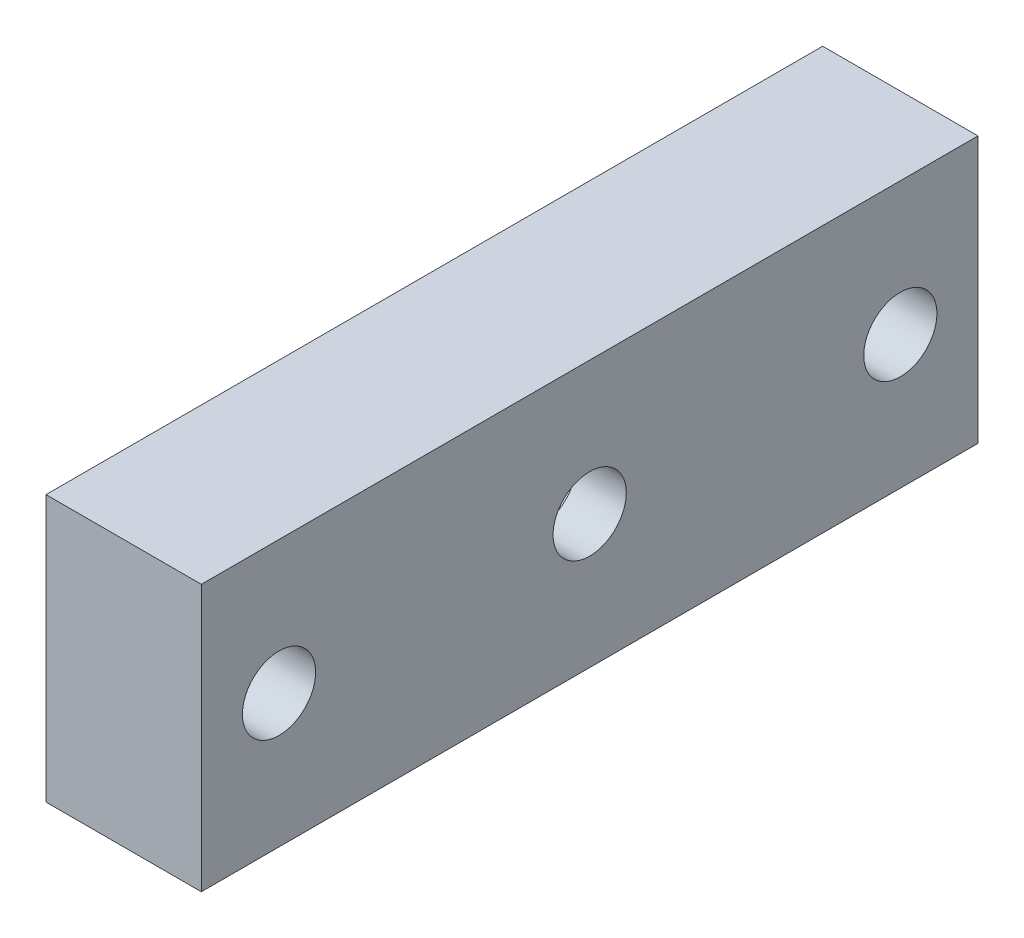
ISO-10303-21;
HEADER;
FILE_DESCRIPTION(('STEP AP214'),'2;1');
FILE_NAME('part.step','',(''),(''),'','','');
FILE_SCHEMA(('AUTOMOTIVE_DESIGN { 1 0 10303 214 1 1 1 1 }'));
ENDSEC;
DATA;
#1=APPLICATION_CONTEXT('core data for automotive mechanical design processes');
#2=APPLICATION_PROTOCOL_DEFINITION('international standard','automotive_design',2000,#1);
#3=PRODUCT_CONTEXT('',#1,'mechanical');
#4=PRODUCT('Part','Part','',(#3));
#5=PRODUCT_RELATED_PRODUCT_CATEGORY('part','',(#4));
#6=PRODUCT_DEFINITION_FORMATION('','',#4);
#7=PRODUCT_DEFINITION_CONTEXT('part definition',#1,'design');
#8=PRODUCT_DEFINITION('design','',#6,#7);
#9=PRODUCT_DEFINITION_SHAPE('','',#8);
#10=(LENGTH_UNIT() NAMED_UNIT(*) SI_UNIT(.MILLI.,.METRE.));
#11=(NAMED_UNIT(*) PLANE_ANGLE_UNIT() SI_UNIT($,.RADIAN.));
#12=(NAMED_UNIT(*) SI_UNIT($,.STERADIAN.) SOLID_ANGLE_UNIT());
#13=UNCERTAINTY_MEASURE_WITH_UNIT(LENGTH_MEASURE(1.E-05),#10,'distance_accuracy_value','');
#14=(GEOMETRIC_REPRESENTATION_CONTEXT(3) GLOBAL_UNCERTAINTY_ASSIGNED_CONTEXT((#13)) GLOBAL_UNIT_ASSIGNED_CONTEXT((#10,
#11,#12)) REPRESENTATION_CONTEXT('',''));
#15=CARTESIAN_POINT('',(0.,0.,0.));
#16=DIRECTION('',(0.,0.,1.));
#17=DIRECTION('',(1.,0.,0.));
#18=AXIS2_PLACEMENT_3D('',#15,#16,#17);
#19=CARTESIAN_POINT('',(7.,6.,-17.5));
#20=DIRECTION('',(-1.,0.,0.));
#21=DIRECTION('',(0.,0.,1.));
#22=AXIS2_PLACEMENT_3D('',#19,#20,#21);
#23=CYLINDRICAL_SURFACE('',#22,1.65);
#24=CARTESIAN_POINT('',(0.,6.,-17.5));
#25=DIRECTION('',(1.,0.,0.));
#26=DIRECTION('',(0.,0.,-1.));
#27=AXIS2_PLACEMENT_3D('',#24,#25,#26);
#28=CIRCLE('',#27,1.65);
#29=CARTESIAN_POINT('',(0.,6.,-19.15));
#30=VERTEX_POINT('',#29);
#31=EDGE_CURVE('E189',#30,#30,#28,.T.);
#32=ORIENTED_EDGE('',*,*,#31,.F.);
#33=EDGE_LOOP('',(#32));
#34=FACE_BOUND('',#33,.T.);
#35=CARTESIAN_POINT('',(2.25,6.,-17.5));
#36=DIRECTION('',(1.,0.,0.));
#37=DIRECTION('',(0.,0.,-1.));
#38=AXIS2_PLACEMENT_3D('',#35,#36,#37);
#39=CIRCLE('',#38,1.65);
#40=CARTESIAN_POINT('',(2.25,6.,-19.15));
#41=VERTEX_POINT('',#40);
#42=EDGE_CURVE('E41',#41,#41,#39,.T.);
#43=ORIENTED_EDGE('',*,*,#42,.T.);
#44=EDGE_LOOP('',(#43));
#45=FACE_BOUND('',#44,.T.);
#46=ADVANCED_FACE('F37',(#34,#45),#23,.F.);
#47=CARTESIAN_POINT('',(7.,0.,0.));
#48=DIRECTION('',(-1.,0.,0.));
#49=DIRECTION('',(0.,0.,1.));
#50=AXIS2_PLACEMENT_3D('',#47,#48,#49);
#51=PLANE('',#50);
#52=DIRECTION('',(0.,-1.,0.));
#53=VECTOR('',#52,1.);
#54=CARTESIAN_POINT('',(7.,0.,0.));
#55=LINE('',#54,#53);
#56=CARTESIAN_POINT('',(7.,12.,0.));
#57=VERTEX_POINT('',#56);
#58=CARTESIAN_POINT('',(7.,0.,0.));
#59=VERTEX_POINT('',#58);
#60=EDGE_CURVE('E204',#57,#59,#55,.T.);
#61=ORIENTED_EDGE('',*,*,#60,.T.);
#62=DIRECTION('',(0.,0.,-1.));
#63=VECTOR('',#62,1.);
#64=CARTESIAN_POINT('',(7.,0.,0.));
#65=LINE('',#64,#63);
#66=CARTESIAN_POINT('',(7.,0.,-35.));
#67=VERTEX_POINT('',#66);
#68=EDGE_CURVE('E87',#59,#67,#65,.T.);
#69=ORIENTED_EDGE('',*,*,#68,.T.);
#70=DIRECTION('',(0.,1.,0.));
#71=VECTOR('',#70,1.);
#72=CARTESIAN_POINT('',(7.,0.,-35.));
#73=LINE('',#72,#71);
#74=CARTESIAN_POINT('',(7.,12.,-35.));
#75=VERTEX_POINT('',#74);
#76=EDGE_CURVE('E207',#67,#75,#73,.T.);
#77=ORIENTED_EDGE('',*,*,#76,.T.);
#78=DIRECTION('',(0.,0.,1.));
#79=VECTOR('',#78,1.);
#80=CARTESIAN_POINT('',(7.,12.,0.));
#81=LINE('',#80,#79);
#82=EDGE_CURVE('E56',#75,#57,#81,.T.);
#83=ORIENTED_EDGE('',*,*,#82,.T.);
#84=EDGE_LOOP('',(#61,#69,#77,#83));
#85=FACE_BOUND('',#84,.T.);
#86=CARTESIAN_POINT('',(7.,6.,-3.5));
#87=DIRECTION('',(1.,0.,0.));
#88=DIRECTION('',(0.,0.,-1.));
#89=AXIS2_PLACEMENT_3D('',#86,#87,#88);
#90=CIRCLE('',#89,1.65);
#91=CARTESIAN_POINT('',(7.,6.,-5.15));
#92=VERTEX_POINT('',#91);
#93=EDGE_CURVE('E198',#92,#92,#90,.T.);
#94=ORIENTED_EDGE('',*,*,#93,.F.);
#95=EDGE_LOOP('',(#94));
#96=FACE_BOUND('',#95,.T.);
#97=CARTESIAN_POINT('',(7.,6.,-31.5));
#98=DIRECTION('',(1.,0.,0.));
#99=DIRECTION('',(0.,0.,-1.));
#100=AXIS2_PLACEMENT_3D('',#97,#98,#99);
#101=CIRCLE('',#100,1.65);
#102=CARTESIAN_POINT('',(7.,6.,-33.15));
#103=VERTEX_POINT('',#102);
#104=EDGE_CURVE('E192',#103,#103,#101,.T.);
#105=ORIENTED_EDGE('',*,*,#104,.F.);
#106=EDGE_LOOP('',(#105));
#107=FACE_BOUND('',#106,.T.);
#108=CARTESIAN_POINT('',(7.,6.,-17.5));
#109=DIRECTION('',(1.,0.,0.));
#110=DIRECTION('',(0.,0.,-1.));
#111=AXIS2_PLACEMENT_3D('',#108,#109,#110);
#112=CIRCLE('',#111,1.65);
#113=CARTESIAN_POINT('',(7.,6.,-19.15));
#114=VERTEX_POINT('',#113);
#115=EDGE_CURVE('E185',#114,#114,#112,.T.);
#116=ORIENTED_EDGE('',*,*,#115,.F.);
#117=EDGE_LOOP('',(#116));
#118=FACE_BOUND('',#117,.T.);
#119=ADVANCED_FACE('F238',(#85,#96,#107,#118),#51,.F.);
#120=CARTESIAN_POINT('',(0.,0.,0.));
#121=DIRECTION('',(-1.,0.,0.));
#122=DIRECTION('',(0.,0.,1.));
#123=AXIS2_PLACEMENT_3D('',#120,#121,#122);
#124=PLANE('',#123);
#125=CARTESIAN_POINT('',(0.,6.,-31.5));
#126=DIRECTION('',(1.,0.,0.));
#127=DIRECTION('',(0.,0.,-1.));
#128=AXIS2_PLACEMENT_3D('',#125,#126,#127);
#129=CIRCLE('',#128,1.65);
#130=CARTESIAN_POINT('',(0.,6.,-33.15));
#131=VERTEX_POINT('',#130);
#132=EDGE_CURVE('E188',#131,#131,#129,.T.);
#133=ORIENTED_EDGE('',*,*,#132,.T.);
#134=EDGE_LOOP('',(#133));
#135=FACE_BOUND('',#134,.T.);
#136=DIRECTION('',(0.,-1.,0.));
#137=VECTOR('',#136,1.);
#138=CARTESIAN_POINT('',(0.,0.,0.));
#139=LINE('',#138,#137);
#140=CARTESIAN_POINT('',(0.,12.,0.));
#141=VERTEX_POINT('',#140);
#142=CARTESIAN_POINT('',(0.,0.,0.));
#143=VERTEX_POINT('',#142);
#144=EDGE_CURVE('E201',#141,#143,#139,.T.);
#145=ORIENTED_EDGE('',*,*,#144,.F.);
#146=DIRECTION('',(0.,0.,1.));
#147=VECTOR('',#146,1.);
#148=CARTESIAN_POINT('',(0.,12.,0.));
#149=LINE('',#148,#147);
#150=CARTESIAN_POINT('',(0.,12.,-35.));
#151=VERTEX_POINT('',#150);
#152=EDGE_CURVE('E80',#151,#141,#149,.T.);
#153=ORIENTED_EDGE('',*,*,#152,.F.);
#154=DIRECTION('',(0.,1.,0.));
#155=VECTOR('',#154,1.);
#156=CARTESIAN_POINT('',(0.,0.,-35.));
#157=LINE('',#156,#155);
#158=CARTESIAN_POINT('',(0.,0.,-35.));
#159=VERTEX_POINT('',#158);
#160=EDGE_CURVE('E74',#159,#151,#157,.T.);
#161=ORIENTED_EDGE('',*,*,#160,.F.);
#162=DIRECTION('',(0.,0.,-1.));
#163=VECTOR('',#162,1.);
#164=CARTESIAN_POINT('',(0.,0.,0.));
#165=LINE('',#164,#163);
#166=EDGE_CURVE('E213',#143,#159,#165,.T.);
#167=ORIENTED_EDGE('',*,*,#166,.F.);
#168=EDGE_LOOP('',(#145,#153,#161,#167));
#169=FACE_BOUND('',#168,.T.);
#170=CARTESIAN_POINT('',(0.,6.,-3.5));
#171=DIRECTION('',(1.,0.,0.));
#172=DIRECTION('',(0.,0.,-1.));
#173=AXIS2_PLACEMENT_3D('',#170,#171,#172);
#174=CIRCLE('',#173,1.65);
#175=CARTESIAN_POINT('',(0.,6.,-5.15));
#176=VERTEX_POINT('',#175);
#177=EDGE_CURVE('E195',#176,#176,#174,.T.);
#178=ORIENTED_EDGE('',*,*,#177,.T.);
#179=EDGE_LOOP('',(#178));
#180=FACE_BOUND('',#179,.T.);
#181=ORIENTED_EDGE('',*,*,#31,.T.);
#182=EDGE_LOOP('',(#181));
#183=FACE_BOUND('',#182,.T.);
#184=ADVANCED_FACE('F247',(#135,#169,#180,#183),#124,.T.);
#185=CARTESIAN_POINT('',(7.,0.,0.));
#186=DIRECTION('',(0.,0.,-1.));
#187=DIRECTION('',(-1.,0.,0.));
#188=AXIS2_PLACEMENT_3D('',#185,#186,#187);
#189=PLANE('',#188);
#190=ORIENTED_EDGE('',*,*,#144,.T.);
#191=DIRECTION('',(-1.,0.,0.));
#192=VECTOR('',#191,1.);
#193=CARTESIAN_POINT('',(7.,0.,0.));
#194=LINE('',#193,#192);
#195=EDGE_CURVE('E11',#59,#143,#194,.T.);
#196=ORIENTED_EDGE('',*,*,#195,.F.);
#197=ORIENTED_EDGE('',*,*,#60,.F.);
#198=DIRECTION('',(-1.,0.,0.));
#199=VECTOR('',#198,1.);
#200=CARTESIAN_POINT('',(7.,12.,0.));
#201=LINE('',#200,#199);
#202=EDGE_CURVE('E210',#57,#141,#201,.T.);
#203=ORIENTED_EDGE('',*,*,#202,.T.);
#204=EDGE_LOOP('',(#190,#196,#197,#203));
#205=FACE_BOUND('',#204,.T.);
#206=ADVANCED_FACE('F39',(#205),#189,.F.);
#207=CARTESIAN_POINT('',(7.,0.,0.));
#208=DIRECTION('',(0.,1.,0.));
#209=DIRECTION('',(0.,0.,1.));
#210=AXIS2_PLACEMENT_3D('',#207,#208,#209);
#211=PLANE('',#210);
#212=ORIENTED_EDGE('',*,*,#166,.T.);
#213=DIRECTION('',(-1.,0.,0.));
#214=VECTOR('',#213,1.);
#215=CARTESIAN_POINT('',(7.,0.,-35.));
#216=LINE('',#215,#214);
#217=EDGE_CURVE('E47',#67,#159,#216,.T.);
#218=ORIENTED_EDGE('',*,*,#217,.F.);
#219=ORIENTED_EDGE('',*,*,#68,.F.);
#220=ORIENTED_EDGE('',*,*,#195,.T.);
#221=EDGE_LOOP('',(#212,#218,#219,#220));
#222=FACE_BOUND('',#221,.T.);
#223=ADVANCED_FACE('F278',(#222),#211,.F.);
#224=CARTESIAN_POINT('',(7.,0.,-35.));
#225=DIRECTION('',(0.,0.,1.));
#226=DIRECTION('',(1.,0.,0.));
#227=AXIS2_PLACEMENT_3D('',#224,#225,#226);
#228=PLANE('',#227);
#229=ORIENTED_EDGE('',*,*,#160,.T.);
#230=DIRECTION('',(-1.,0.,0.));
#231=VECTOR('',#230,1.);
#232=CARTESIAN_POINT('',(7.,12.,-35.));
#233=LINE('',#232,#231);
#234=EDGE_CURVE('E218',#75,#151,#233,.T.);
#235=ORIENTED_EDGE('',*,*,#234,.F.);
#236=ORIENTED_EDGE('',*,*,#76,.F.);
#237=ORIENTED_EDGE('',*,*,#217,.T.);
#238=EDGE_LOOP('',(#229,#235,#236,#237));
#239=FACE_BOUND('',#238,.T.);
#240=ADVANCED_FACE('F276',(#239),#228,.F.);
#241=CARTESIAN_POINT('',(7.,12.,0.));
#242=DIRECTION('',(0.,-1.,0.));
#243=DIRECTION('',(0.,0.,-1.));
#244=AXIS2_PLACEMENT_3D('',#241,#242,#243);
#245=PLANE('',#244);
#246=ORIENTED_EDGE('',*,*,#152,.T.);
#247=ORIENTED_EDGE('',*,*,#202,.F.);
#248=ORIENTED_EDGE('',*,*,#82,.F.);
#249=ORIENTED_EDGE('',*,*,#234,.T.);
#250=EDGE_LOOP('',(#246,#247,#248,#249));
#251=FACE_BOUND('',#250,.T.);
#252=ADVANCED_FACE('F266',(#251),#245,.F.);
#253=CARTESIAN_POINT('',(7.,6.,-3.5));
#254=DIRECTION('',(-1.,0.,0.));
#255=DIRECTION('',(0.,0.,1.));
#256=AXIS2_PLACEMENT_3D('',#253,#254,#255);
#257=CYLINDRICAL_SURFACE('',#256,1.65);
#258=ORIENTED_EDGE('',*,*,#93,.T.);
#259=EDGE_LOOP('',(#258));
#260=FACE_BOUND('',#259,.T.);
#261=ORIENTED_EDGE('',*,*,#177,.F.);
#262=EDGE_LOOP('',(#261));
#263=FACE_BOUND('',#262,.T.);
#264=ADVANCED_FACE('F258',(#260,#263),#257,.F.);
#265=CARTESIAN_POINT('',(7.,6.,-31.5));
#266=DIRECTION('',(-1.,0.,0.));
#267=DIRECTION('',(0.,0.,1.));
#268=AXIS2_PLACEMENT_3D('',#265,#266,#267);
#269=CYLINDRICAL_SURFACE('',#268,1.65);
#270=ORIENTED_EDGE('',*,*,#104,.T.);
#271=EDGE_LOOP('',(#270));
#272=FACE_BOUND('',#271,.T.);
#273=ORIENTED_EDGE('',*,*,#132,.F.);
#274=EDGE_LOOP('',(#273));
#275=FACE_BOUND('',#274,.T.);
#276=ADVANCED_FACE('F252',(#272,#275),#269,.F.);
#277=CARTESIAN_POINT('',(4.75,6.,-17.5));
#278=DIRECTION('',(1.,0.,0.));
#279=DIRECTION('',(0.,0.,-1.));
#280=AXIS2_PLACEMENT_3D('',#277,#278,#279);
#281=CIRCLE('',#280,1.65);
#282=CARTESIAN_POINT('',(4.75,6.,-19.15));
#283=VERTEX_POINT('',#282);
#284=EDGE_CURVE('E177',#283,#283,#281,.T.);
#285=ORIENTED_EDGE('',*,*,#284,.F.);
#286=EDGE_LOOP('',(#285));
#287=FACE_BOUND('',#286,.T.);
#288=ORIENTED_EDGE('',*,*,#115,.T.);
#289=EDGE_LOOP('',(#288));
#290=FACE_BOUND('',#289,.T.);
#291=ADVANCED_FACE('F241',(#287,#290),#23,.F.);
#292=CARTESIAN_POINT('',(2.25,3.14999999999999,-19.1454482671904));
#293=DIRECTION('',(0.,-0.5,-0.866025403784439));
#294=DIRECTION('',(0.,0.866025403784439,-0.5));
#295=AXIS2_PLACEMENT_3D('',#292,#293,#294);
#296=PLANE('',#295);
#297=DIRECTION('',(0.,0.866025403784439,-0.5));
#298=VECTOR('',#297,1.);
#299=CARTESIAN_POINT('',(4.75,3.14999999999999,-19.1454482671904));
#300=LINE('',#299,#298);
#301=CARTESIAN_POINT('',(4.75,3.14999999999999,-19.1454482671904));
#302=VERTEX_POINT('',#301);
#303=CARTESIAN_POINT('',(4.75,6.,-20.7908965343809));
#304=VERTEX_POINT('',#303);
#305=EDGE_CURVE('E133',#302,#304,#300,.T.);
#306=ORIENTED_EDGE('',*,*,#305,.T.);
#307=DIRECTION('',(1.,0.,0.));
#308=VECTOR('',#307,1.);
#309=CARTESIAN_POINT('',(2.25,6.,-20.7908965343809));
#310=LINE('',#309,#308);
#311=CARTESIAN_POINT('',(2.25,6.,-20.7908965343809));
#312=VERTEX_POINT('',#311);
#313=EDGE_CURVE('E126',#312,#304,#310,.T.);
#314=ORIENTED_EDGE('',*,*,#313,.F.);
#315=DIRECTION('',(0.,0.866025403784439,-0.5));
#316=VECTOR('',#315,1.);
#317=CARTESIAN_POINT('',(2.25,3.14999999999999,-19.1454482671904));
#318=LINE('',#317,#316);
#319=CARTESIAN_POINT('',(2.25,3.14999999999999,-19.1454482671904));
#320=VERTEX_POINT('',#319);
#321=EDGE_CURVE('E130',#320,#312,#318,.T.);
#322=ORIENTED_EDGE('',*,*,#321,.F.);
#323=DIRECTION('',(1.,0.,0.));
#324=VECTOR('',#323,1.);
#325=CARTESIAN_POINT('',(2.25,3.14999999999999,-19.1454482671904));
#326=LINE('',#325,#324);
#327=EDGE_CURVE('E175',#320,#302,#326,.T.);
#328=ORIENTED_EDGE('',*,*,#327,.T.);
#329=EDGE_LOOP('',(#306,#314,#322,#328));
#330=FACE_BOUND('',#329,.T.);
#331=ADVANCED_FACE('F128',(#330),#296,.F.);
#332=CARTESIAN_POINT('',(2.25,3.14999999999999,-15.8545517328096));
#333=DIRECTION('',(0.,-1.,0.));
#334=DIRECTION('',(0.,0.,-1.));
#335=AXIS2_PLACEMENT_3D('',#332,#333,#334);
#336=PLANE('',#335);
#337=DIRECTION('',(0.,0.,-1.));
#338=VECTOR('',#337,1.);
#339=CARTESIAN_POINT('',(4.75,3.14999999999999,-15.8545517328096));
#340=LINE('',#339,#338);
#341=CARTESIAN_POINT('',(4.75,3.14999999999999,-15.8545517328096));
#342=VERTEX_POINT('',#341);
#343=EDGE_CURVE('E151',#342,#302,#340,.T.);
#344=ORIENTED_EDGE('',*,*,#343,.T.);
#345=ORIENTED_EDGE('',*,*,#327,.F.);
#346=DIRECTION('',(0.,0.,-1.));
#347=VECTOR('',#346,1.);
#348=CARTESIAN_POINT('',(2.25,3.14999999999999,-15.8545517328096));
#349=LINE('',#348,#347);
#350=CARTESIAN_POINT('',(2.25,3.14999999999999,-15.8545517328096));
#351=VERTEX_POINT('',#350);
#352=EDGE_CURVE('E138',#351,#320,#349,.T.);
#353=ORIENTED_EDGE('',*,*,#352,.F.);
#354=DIRECTION('',(1.,0.,0.));
#355=VECTOR('',#354,1.);
#356=CARTESIAN_POINT('',(2.25,3.14999999999999,-15.8545517328096));
#357=LINE('',#356,#355);
#358=EDGE_CURVE('E178',#351,#342,#357,.T.);
#359=ORIENTED_EDGE('',*,*,#358,.T.);
#360=EDGE_LOOP('',(#344,#345,#353,#359));
#361=FACE_BOUND('',#360,.T.);
#362=ADVANCED_FACE('F257',(#361),#336,.F.);
#363=CARTESIAN_POINT('',(2.25,6.,-14.2091034656191));
#364=DIRECTION('',(0.,-0.5,0.866025403784439));
#365=DIRECTION('',(0.,-0.866025403784439,-0.5));
#366=AXIS2_PLACEMENT_3D('',#363,#364,#365);
#367=PLANE('',#366);
#368=DIRECTION('',(0.,-0.866025403784439,-0.5));
#369=VECTOR('',#368,1.);
#370=CARTESIAN_POINT('',(4.75,6.,-14.2091034656191));
#371=LINE('',#370,#369);
#372=CARTESIAN_POINT('',(4.75,6.,-14.2091034656191));
#373=VERTEX_POINT('',#372);
#374=EDGE_CURVE('E154',#373,#342,#371,.T.);
#375=ORIENTED_EDGE('',*,*,#374,.T.);
#376=ORIENTED_EDGE('',*,*,#358,.F.);
#377=DIRECTION('',(0.,-0.866025403784439,-0.5));
#378=VECTOR('',#377,1.);
#379=CARTESIAN_POINT('',(2.25,6.,-14.2091034656191));
#380=LINE('',#379,#378);
#381=CARTESIAN_POINT('',(2.25,6.,-14.2091034656191));
#382=VERTEX_POINT('',#381);
#383=EDGE_CURVE('E161',#382,#351,#380,.T.);
#384=ORIENTED_EDGE('',*,*,#383,.F.);
#385=DIRECTION('',(1.,0.,0.));
#386=VECTOR('',#385,1.);
#387=CARTESIAN_POINT('',(2.25,6.,-14.2091034656191));
#388=LINE('',#387,#386);
#389=EDGE_CURVE('E180',#382,#373,#388,.T.);
#390=ORIENTED_EDGE('',*,*,#389,.T.);
#391=EDGE_LOOP('',(#375,#376,#384,#390));
#392=FACE_BOUND('',#391,.T.);
#393=ADVANCED_FACE('F338',(#392),#367,.F.);
#394=CARTESIAN_POINT('',(2.25,8.85000000000001,-15.8545517328096));
#395=DIRECTION('',(0.,0.499999999999999,0.866025403784439));
#396=DIRECTION('',(0.,-0.866025403784439,0.499999999999999));
#397=AXIS2_PLACEMENT_3D('',#394,#395,#396);
#398=PLANE('',#397);
#399=DIRECTION('',(0.,-0.866025403784439,0.499999999999999));
#400=VECTOR('',#399,1.);
#401=CARTESIAN_POINT('',(4.75,8.85000000000001,-15.8545517328096));
#402=LINE('',#401,#400);
#403=CARTESIAN_POINT('',(4.75,8.85000000000001,-15.8545517328096));
#404=VERTEX_POINT('',#403);
#405=EDGE_CURVE('E170',#404,#373,#402,.T.);
#406=ORIENTED_EDGE('',*,*,#405,.T.);
#407=ORIENTED_EDGE('',*,*,#389,.F.);
#408=DIRECTION('',(0.,-0.866025403784439,0.499999999999999));
#409=VECTOR('',#408,1.);
#410=CARTESIAN_POINT('',(2.25,8.85000000000001,-15.8545517328096));
#411=LINE('',#410,#409);
#412=CARTESIAN_POINT('',(2.25,8.85000000000001,-15.8545517328096));
#413=VERTEX_POINT('',#412);
#414=EDGE_CURVE('E158',#413,#382,#411,.T.);
#415=ORIENTED_EDGE('',*,*,#414,.F.);
#416=DIRECTION('',(1.,0.,0.));
#417=VECTOR('',#416,1.);
#418=CARTESIAN_POINT('',(2.25,8.85000000000001,-15.8545517328096));
#419=LINE('',#418,#417);
#420=EDGE_CURVE('E182',#413,#404,#419,.T.);
#421=ORIENTED_EDGE('',*,*,#420,.T.);
#422=EDGE_LOOP('',(#406,#407,#415,#421));
#423=FACE_BOUND('',#422,.T.);
#424=ADVANCED_FACE('F346',(#423),#398,.F.);
#425=CARTESIAN_POINT('',(2.25,8.85000000000001,-19.1454482671904));
#426=DIRECTION('',(0.,1.,0.));
#427=DIRECTION('',(0.,0.,1.));
#428=AXIS2_PLACEMENT_3D('',#425,#426,#427);
#429=PLANE('',#428);
#430=DIRECTION('',(0.,0.,1.));
#431=VECTOR('',#430,1.);
#432=CARTESIAN_POINT('',(4.75,8.85000000000001,-19.1454482671904));
#433=LINE('',#432,#431);
#434=CARTESIAN_POINT('',(4.75,8.85000000000001,-19.1454482671904));
#435=VERTEX_POINT('',#434);
#436=EDGE_CURVE('E167',#435,#404,#433,.T.);
#437=ORIENTED_EDGE('',*,*,#436,.T.);
#438=ORIENTED_EDGE('',*,*,#420,.F.);
#439=DIRECTION('',(0.,0.,1.));
#440=VECTOR('',#439,1.);
#441=CARTESIAN_POINT('',(2.25,8.85000000000001,-19.1454482671904));
#442=LINE('',#441,#440);
#443=CARTESIAN_POINT('',(2.25,8.85000000000001,-19.1454482671904));
#444=VERTEX_POINT('',#443);
#445=EDGE_CURVE('E146',#444,#413,#442,.T.);
#446=ORIENTED_EDGE('',*,*,#445,.F.);
#447=DIRECTION('',(1.,0.,0.));
#448=VECTOR('',#447,1.);
#449=CARTESIAN_POINT('',(2.25,8.85000000000001,-19.1454482671904));
#450=LINE('',#449,#448);
#451=EDGE_CURVE('E137',#444,#435,#450,.T.);
#452=ORIENTED_EDGE('',*,*,#451,.T.);
#453=EDGE_LOOP('',(#437,#438,#446,#452));
#454=FACE_BOUND('',#453,.T.);
#455=ADVANCED_FACE('F235',(#454),#429,.F.);
#456=CARTESIAN_POINT('',(2.25,6.,-20.7908965343809));
#457=DIRECTION('',(0.,0.5,-0.866025403784439));
#458=DIRECTION('',(0.,0.866025403784439,0.5));
#459=AXIS2_PLACEMENT_3D('',#456,#457,#458);
#460=PLANE('',#459);
#461=DIRECTION('',(0.,0.866025403784439,0.5));
#462=VECTOR('',#461,1.);
#463=CARTESIAN_POINT('',(4.75,6.,-20.7908965343809));
#464=LINE('',#463,#462);
#465=EDGE_CURVE('E165',#304,#435,#464,.T.);
#466=ORIENTED_EDGE('',*,*,#465,.T.);
#467=ORIENTED_EDGE('',*,*,#451,.F.);
#468=DIRECTION('',(0.,0.866025403784439,0.5));
#469=VECTOR('',#468,1.);
#470=CARTESIAN_POINT('',(2.25,6.,-20.7908965343809));
#471=LINE('',#470,#469);
#472=EDGE_CURVE('E141',#312,#444,#471,.T.);
#473=ORIENTED_EDGE('',*,*,#472,.F.);
#474=ORIENTED_EDGE('',*,*,#313,.T.);
#475=EDGE_LOOP('',(#466,#467,#473,#474));
#476=FACE_BOUND('',#475,.T.);
#477=ADVANCED_FACE('F142',(#476),#460,.F.);
#478=CARTESIAN_POINT('',(2.25,0.,0.));
#479=DIRECTION('',(1.,0.,0.));
#480=DIRECTION('',(0.,0.,-1.));
#481=AXIS2_PLACEMENT_3D('',#478,#479,#480);
#482=PLANE('',#481);
#483=ORIENTED_EDGE('',*,*,#42,.F.);
#484=EDGE_LOOP('',(#483));
#485=FACE_BOUND('',#484,.T.);
#486=ORIENTED_EDGE('',*,*,#321,.T.);
#487=ORIENTED_EDGE('',*,*,#472,.T.);
#488=ORIENTED_EDGE('',*,*,#445,.T.);
#489=ORIENTED_EDGE('',*,*,#414,.T.);
#490=ORIENTED_EDGE('',*,*,#383,.T.);
#491=ORIENTED_EDGE('',*,*,#352,.T.);
#492=EDGE_LOOP('',(#486,#487,#488,#489,#490,#491));
#493=FACE_BOUND('',#492,.T.);
#494=ADVANCED_FACE('F148',(#485,#493),#482,.T.);
#495=CARTESIAN_POINT('',(4.75,0.,0.));
#496=DIRECTION('',(1.,0.,0.));
#497=DIRECTION('',(0.,0.,-1.));
#498=AXIS2_PLACEMENT_3D('',#495,#496,#497);
#499=PLANE('',#498);
#500=ORIENTED_EDGE('',*,*,#284,.T.);
#501=EDGE_LOOP('',(#500));
#502=FACE_BOUND('',#501,.T.);
#503=ORIENTED_EDGE('',*,*,#305,.F.);
#504=ORIENTED_EDGE('',*,*,#343,.F.);
#505=ORIENTED_EDGE('',*,*,#374,.F.);
#506=ORIENTED_EDGE('',*,*,#405,.F.);
#507=ORIENTED_EDGE('',*,*,#436,.F.);
#508=ORIENTED_EDGE('',*,*,#465,.F.);
#509=EDGE_LOOP('',(#503,#504,#505,#506,#507,#508));
#510=FACE_BOUND('',#509,.T.);
#511=ADVANCED_FACE('F228',(#502,#510),#499,.F.);
#512=CLOSED_SHELL('',(#46,#119,#184,#206,#223,#240,#252,#264,#276,#291,#331,#362,#393,#424,#455,
#477,#494,#511));
#513=MANIFOLD_SOLID_BREP('B2',#512);
#514=ADVANCED_BREP_SHAPE_REPRESENTATION('',(#18,#513),#14);
#515=SHAPE_DEFINITION_REPRESENTATION(#9,#514);
ENDSEC;
END-ISO-10303-21;
